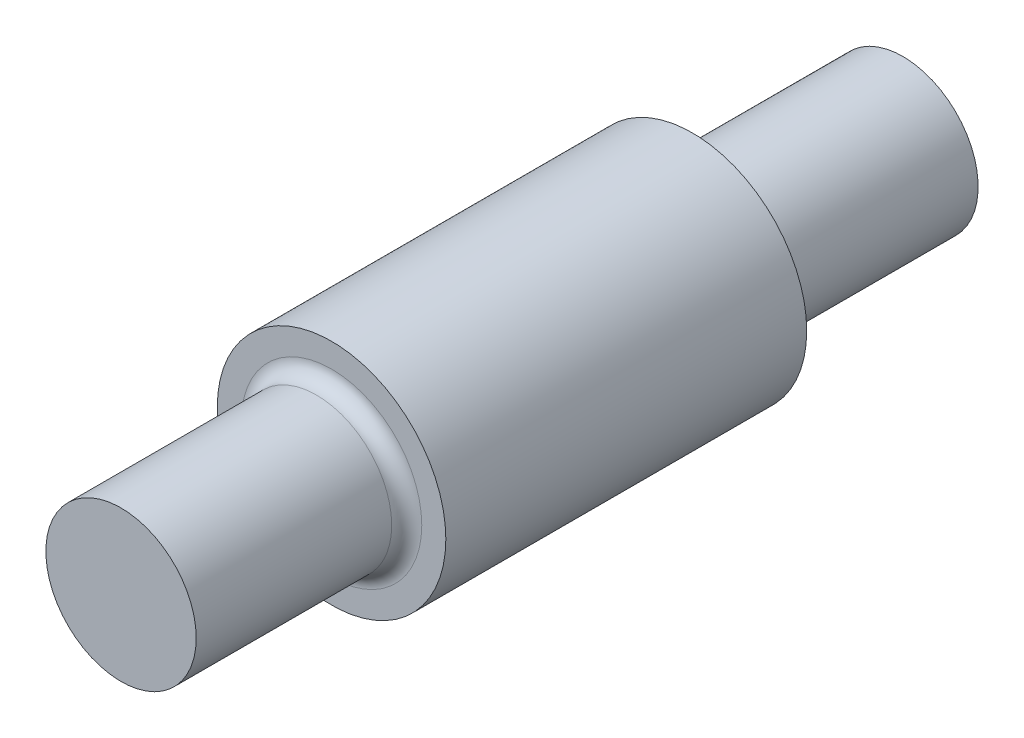
ISO-10303-21;
HEADER;
FILE_DESCRIPTION(('STEP AP214'),'2;1');
FILE_NAME('part.step','',(''),(''),'','','');
FILE_SCHEMA(('AUTOMOTIVE_DESIGN { 1 0 10303 214 1 1 1 1 }'));
ENDSEC;
DATA;
#1=APPLICATION_CONTEXT('core data for automotive mechanical design processes');
#2=APPLICATION_PROTOCOL_DEFINITION('international standard','automotive_design',2000,#1);
#3=PRODUCT_CONTEXT('',#1,'mechanical');
#4=PRODUCT('Part','Part','',(#3));
#5=PRODUCT_RELATED_PRODUCT_CATEGORY('part','',(#4));
#6=PRODUCT_DEFINITION_FORMATION('','',#4);
#7=PRODUCT_DEFINITION_CONTEXT('part definition',#1,'design');
#8=PRODUCT_DEFINITION('design','',#6,#7);
#9=PRODUCT_DEFINITION_SHAPE('','',#8);
#10=(LENGTH_UNIT() NAMED_UNIT(*) SI_UNIT(.MILLI.,.METRE.));
#11=(NAMED_UNIT(*) PLANE_ANGLE_UNIT() SI_UNIT($,.RADIAN.));
#12=(NAMED_UNIT(*) SI_UNIT($,.STERADIAN.) SOLID_ANGLE_UNIT());
#13=UNCERTAINTY_MEASURE_WITH_UNIT(LENGTH_MEASURE(1.E-05),#10,'distance_accuracy_value','');
#14=(GEOMETRIC_REPRESENTATION_CONTEXT(3) GLOBAL_UNCERTAINTY_ASSIGNED_CONTEXT((#13)) GLOBAL_UNIT_ASSIGNED_CONTEXT((#10,
#11,#12)) REPRESENTATION_CONTEXT('',''));
#15=CARTESIAN_POINT('',(0.,0.,0.));
#16=DIRECTION('',(0.,0.,1.));
#17=DIRECTION('',(1.,0.,0.));
#18=AXIS2_PLACEMENT_3D('',#15,#16,#17);
#19=CARTESIAN_POINT('',(0.,0.,130.));
#20=DIRECTION('',(0.,0.,-1.));
#21=DIRECTION('',(-1.,0.,0.));
#22=AXIS2_PLACEMENT_3D('',#19,#20,#21);
#23=CYLINDRICAL_SURFACE('',#22,19.);
#24=CARTESIAN_POINT('',(0.,0.,95.));
#25=DIRECTION('',(0.,0.,1.));
#26=DIRECTION('',(1.,0.,0.));
#27=AXIS2_PLACEMENT_3D('',#24,#25,#26);
#28=CIRCLE('',#27,19.);
#29=CARTESIAN_POINT('',(19.,0.,95.));
#30=VERTEX_POINT('',#29);
#31=EDGE_CURVE('E72',#30,#30,#28,.T.);
#32=ORIENTED_EDGE('',*,*,#31,.F.);
#33=EDGE_LOOP('',(#32));
#34=FACE_BOUND('',#33,.T.);
#35=CARTESIAN_POINT('',(0.,0.,35.));
#36=DIRECTION('',(0.,0.,-1.));
#37=DIRECTION('',(-1.,0.,0.));
#38=AXIS2_PLACEMENT_3D('',#35,#36,#37);
#39=CIRCLE('',#38,19.);
#40=CARTESIAN_POINT('',(-19.,0.,35.));
#41=VERTEX_POINT('',#40);
#42=EDGE_CURVE('E80',#41,#41,#39,.T.);
#43=ORIENTED_EDGE('',*,*,#42,.F.);
#44=EDGE_LOOP('',(#43));
#45=FACE_BOUND('',#44,.T.);
#46=ADVANCED_FACE('F48',(#34,#45),#23,.T.);
#47=CARTESIAN_POINT('',(0.,0.,95.));
#48=DIRECTION('',(0.,0.,1.));
#49=DIRECTION('',(1.,0.,0.));
#50=AXIS2_PLACEMENT_3D('',#47,#48,#49);
#51=PLANE('',#50);
#52=CARTESIAN_POINT('',(0.,0.,95.));
#53=DIRECTION('',(0.,0.,1.));
#54=DIRECTION('',(1.,0.,0.));
#55=AXIS2_PLACEMENT_3D('',#52,#53,#54);
#56=CIRCLE('',#55,15.);
#57=CARTESIAN_POINT('',(15.,0.,95.));
#58=VERTEX_POINT('',#57);
#59=EDGE_CURVE('E61',#58,#58,#56,.F.);
#60=ORIENTED_EDGE('',*,*,#59,.T.);
#61=EDGE_LOOP('',(#60));
#62=FACE_BOUND('',#61,.T.);
#63=ORIENTED_EDGE('',*,*,#31,.T.);
#64=EDGE_LOOP('',(#63));
#65=FACE_BOUND('',#64,.T.);
#66=ADVANCED_FACE('F105',(#62,#65),#51,.T.);
#67=CARTESIAN_POINT('',(0.,0.,95.));
#68=DIRECTION('',(0.,0.,1.));
#69=DIRECTION('',(1.,0.,0.));
#70=AXIS2_PLACEMENT_3D('',#67,#68,#69);
#71=CYLINDRICAL_SURFACE('',#70,12.5);
#72=CARTESIAN_POINT('',(0.,0.,97.5));
#73=DIRECTION('',(0.,0.,1.));
#74=DIRECTION('',(1.,0.,0.));
#75=AXIS2_PLACEMENT_3D('',#72,#73,#74);
#76=CIRCLE('',#75,12.5);
#77=CARTESIAN_POINT('',(12.5,0.,97.5));
#78=VERTEX_POINT('',#77);
#79=EDGE_CURVE('E66',#78,#78,#76,.T.);
#80=ORIENTED_EDGE('',*,*,#79,.T.);
#81=EDGE_LOOP('',(#80));
#82=FACE_BOUND('',#81,.T.);
#83=CARTESIAN_POINT('',(0.,0.,130.));
#84=DIRECTION('',(0.,0.,1.));
#85=DIRECTION('',(1.,0.,0.));
#86=AXIS2_PLACEMENT_3D('',#83,#84,#85);
#87=CIRCLE('',#86,12.5);
#88=CARTESIAN_POINT('',(12.5,0.,130.));
#89=VERTEX_POINT('',#88);
#90=EDGE_CURVE('E76',#89,#89,#87,.T.);
#91=ORIENTED_EDGE('',*,*,#90,.F.);
#92=EDGE_LOOP('',(#91));
#93=FACE_BOUND('',#92,.T.);
#94=ADVANCED_FACE('F112',(#82,#93),#71,.T.);
#95=CARTESIAN_POINT('',(0.,0.,130.));
#96=DIRECTION('',(0.,0.,1.));
#97=DIRECTION('',(1.,0.,0.));
#98=AXIS2_PLACEMENT_3D('',#95,#96,#97);
#99=PLANE('',#98);
#100=ORIENTED_EDGE('',*,*,#90,.T.);
#101=EDGE_LOOP('',(#100));
#102=FACE_BOUND('',#101,.T.);
#103=ADVANCED_FACE('F102',(#102),#99,.T.);
#104=CARTESIAN_POINT('',(0.,0.,35.));
#105=DIRECTION('',(0.,0.,-1.));
#106=DIRECTION('',(-1.,0.,0.));
#107=AXIS2_PLACEMENT_3D('',#104,#105,#106);
#108=PLANE('',#107);
#109=CARTESIAN_POINT('',(0.,0.,35.));
#110=DIRECTION('',(0.,0.,-1.));
#111=DIRECTION('',(-1.,0.,0.));
#112=AXIS2_PLACEMENT_3D('',#109,#110,#111);
#113=CIRCLE('',#112,15.);
#114=CARTESIAN_POINT('',(-15.,0.,35.));
#115=VERTEX_POINT('',#114);
#116=EDGE_CURVE('E11',#115,#115,#113,.F.);
#117=ORIENTED_EDGE('',*,*,#116,.T.);
#118=EDGE_LOOP('',(#117));
#119=FACE_BOUND('',#118,.T.);
#120=ORIENTED_EDGE('',*,*,#42,.T.);
#121=EDGE_LOOP('',(#120));
#122=FACE_BOUND('',#121,.T.);
#123=ADVANCED_FACE('F93',(#119,#122),#108,.T.);
#124=CARTESIAN_POINT('',(0.,0.,35.));
#125=DIRECTION('',(0.,0.,-1.));
#126=DIRECTION('',(-1.,0.,0.));
#127=AXIS2_PLACEMENT_3D('',#124,#125,#126);
#128=CYLINDRICAL_SURFACE('',#127,12.5);
#129=CARTESIAN_POINT('',(0.,0.,32.5));
#130=DIRECTION('',(0.,0.,-1.));
#131=DIRECTION('',(-1.,0.,0.));
#132=AXIS2_PLACEMENT_3D('',#129,#130,#131);
#133=CIRCLE('',#132,12.5);
#134=CARTESIAN_POINT('',(-12.5,0.,32.5));
#135=VERTEX_POINT('',#134);
#136=EDGE_CURVE('E56',#135,#135,#133,.T.);
#137=ORIENTED_EDGE('',*,*,#136,.T.);
#138=EDGE_LOOP('',(#137));
#139=FACE_BOUND('',#138,.T.);
#140=CARTESIAN_POINT('',(0.,0.,0.));
#141=DIRECTION('',(0.,0.,-1.));
#142=DIRECTION('',(-1.,0.,0.));
#143=AXIS2_PLACEMENT_3D('',#140,#141,#142);
#144=CIRCLE('',#143,12.5);
#145=CARTESIAN_POINT('',(-12.5,0.,0.));
#146=VERTEX_POINT('',#145);
#147=EDGE_CURVE('E84',#146,#146,#144,.T.);
#148=ORIENTED_EDGE('',*,*,#147,.F.);
#149=EDGE_LOOP('',(#148));
#150=FACE_BOUND('',#149,.T.);
#151=ADVANCED_FACE('F91',(#139,#150),#128,.T.);
#152=CARTESIAN_POINT('',(0.,0.,0.));
#153=DIRECTION('',(0.,0.,1.));
#154=DIRECTION('',(1.,0.,0.));
#155=AXIS2_PLACEMENT_3D('',#152,#153,#154);
#156=PLANE('',#155);
#157=ORIENTED_EDGE('',*,*,#147,.T.);
#158=EDGE_LOOP('',(#157));
#159=FACE_BOUND('',#158,.T.);
#160=ADVANCED_FACE('F89',(#159),#156,.F.);
#161=CARTESIAN_POINT('',(0.,0.,97.5));
#162=DIRECTION('',(0.,0.,1.));
#163=DIRECTION('',(1.,0.,0.));
#164=AXIS2_PLACEMENT_3D('',#161,#162,#163);
#165=TOROIDAL_SURFACE('',#164,15.,2.5);
#166=ORIENTED_EDGE('',*,*,#59,.F.);
#167=EDGE_LOOP('',(#166));
#168=FACE_BOUND('',#167,.T.);
#169=ORIENTED_EDGE('',*,*,#79,.F.);
#170=EDGE_LOOP('',(#169));
#171=FACE_BOUND('',#170,.T.);
#172=ADVANCED_FACE('F100',(#168,#171),#165,.F.);
#173=CARTESIAN_POINT('',(0.,0.,32.5));
#174=DIRECTION('',(0.,0.,-1.));
#175=DIRECTION('',(-1.,0.,0.));
#176=AXIS2_PLACEMENT_3D('',#173,#174,#175);
#177=TOROIDAL_SURFACE('',#176,15.,2.5);
#178=ORIENTED_EDGE('',*,*,#116,.F.);
#179=EDGE_LOOP('',(#178));
#180=FACE_BOUND('',#179,.T.);
#181=ORIENTED_EDGE('',*,*,#136,.F.);
#182=EDGE_LOOP('',(#181));
#183=FACE_BOUND('',#182,.T.);
#184=ADVANCED_FACE('F50',(#180,#183),#177,.F.);
#185=CLOSED_SHELL('',(#46,#66,#94,#103,#123,#151,#160,#172,#184));
#186=MANIFOLD_SOLID_BREP('B2',#185);
#187=ADVANCED_BREP_SHAPE_REPRESENTATION('',(#18,#186),#14);
#188=SHAPE_DEFINITION_REPRESENTATION(#9,#187);
ENDSEC;
END-ISO-10303-21;
